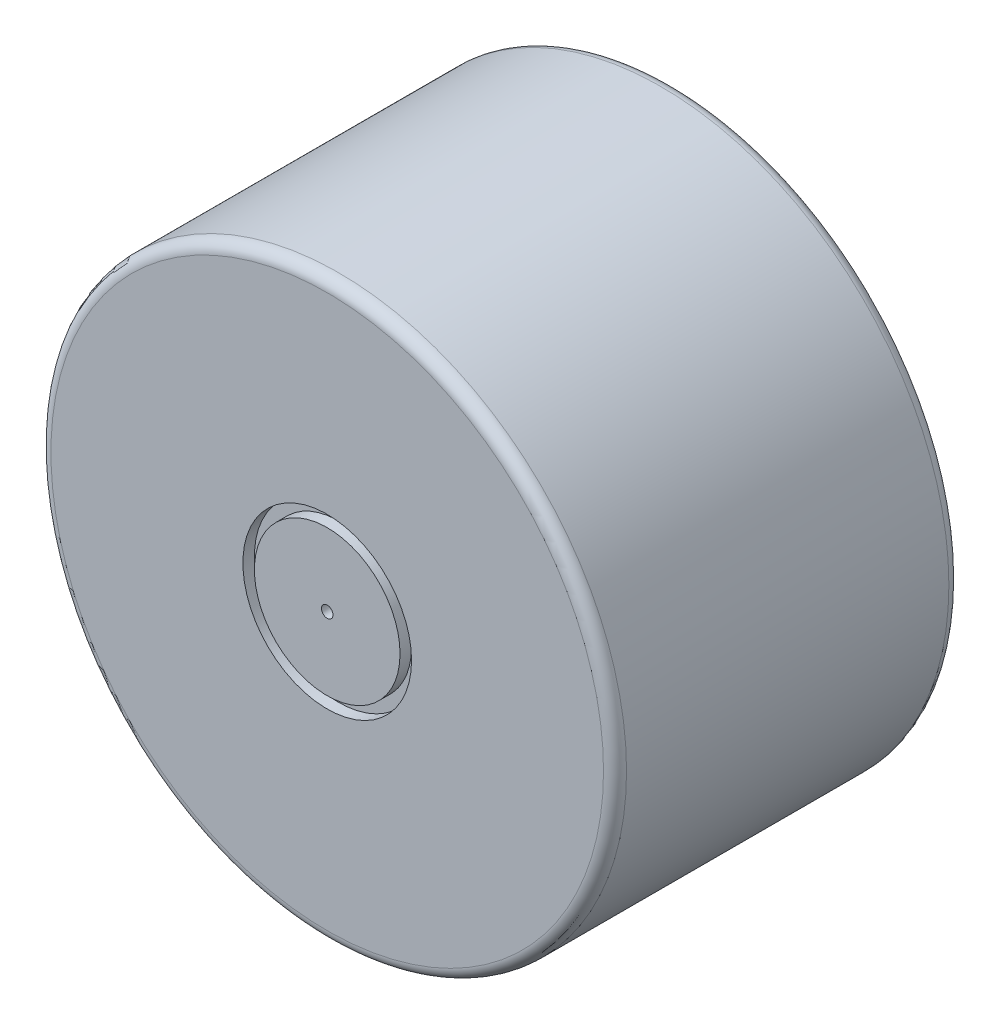
ISO-10303-21;
HEADER;
FILE_DESCRIPTION(('STEP AP214'),'2;1');
FILE_NAME('part.step','',(''),(''),'','','');
FILE_SCHEMA(('AUTOMOTIVE_DESIGN { 1 0 10303 214 1 1 1 1 }'));
ENDSEC;
DATA;
#1=APPLICATION_CONTEXT('core data for automotive mechanical design processes');
#2=APPLICATION_PROTOCOL_DEFINITION('international standard','automotive_design',2000,#1);
#3=PRODUCT_CONTEXT('',#1,'mechanical');
#4=PRODUCT('Part','Part','',(#3));
#5=PRODUCT_RELATED_PRODUCT_CATEGORY('part','',(#4));
#6=PRODUCT_DEFINITION_FORMATION('','',#4);
#7=PRODUCT_DEFINITION_CONTEXT('part definition',#1,'design');
#8=PRODUCT_DEFINITION('design','',#6,#7);
#9=PRODUCT_DEFINITION_SHAPE('','',#8);
#10=(LENGTH_UNIT() NAMED_UNIT(*) SI_UNIT(.MILLI.,.METRE.));
#11=(NAMED_UNIT(*) PLANE_ANGLE_UNIT() SI_UNIT($,.RADIAN.));
#12=(NAMED_UNIT(*) SI_UNIT($,.STERADIAN.) SOLID_ANGLE_UNIT());
#13=UNCERTAINTY_MEASURE_WITH_UNIT(LENGTH_MEASURE(1.E-05),#10,'distance_accuracy_value','');
#14=(GEOMETRIC_REPRESENTATION_CONTEXT(3) GLOBAL_UNCERTAINTY_ASSIGNED_CONTEXT((#13)) GLOBAL_UNIT_ASSIGNED_CONTEXT((#10,
#11,#12)) REPRESENTATION_CONTEXT('',''));
#15=CARTESIAN_POINT('',(0.,0.,0.));
#16=DIRECTION('',(0.,0.,1.));
#17=DIRECTION('',(1.,0.,0.));
#18=AXIS2_PLACEMENT_3D('',#15,#16,#17);
#19=CARTESIAN_POINT('',(0.,0.,100.));
#20=DIRECTION('',(0.,0.,-1.));
#21=DIRECTION('',(-1.,0.,0.));
#22=AXIS2_PLACEMENT_3D('',#19,#20,#21);
#23=CYLINDRICAL_SURFACE('',#22,89.8188429259294);
#24=CARTESIAN_POINT('',(0.,0.,100.));
#25=DIRECTION('',(0.,0.,-1.));
#26=DIRECTION('',(-1.,0.,0.));
#27=AXIS2_PLACEMENT_3D('',#24,#25,#26);
#28=CIRCLE('',#27,89.8188429259294);
#29=CARTESIAN_POINT('',(-89.8188429259294,0.,100.));
#30=VERTEX_POINT('',#29);
#31=EDGE_CURVE('E116',#30,#30,#28,.T.);
#32=ORIENTED_EDGE('',*,*,#31,.T.);
#33=EDGE_LOOP('',(#32));
#34=FACE_BOUND('',#33,.T.);
#35=CARTESIAN_POINT('',(0.,0.,20.));
#36=DIRECTION('',(0.,0.,-1.));
#37=DIRECTION('',(-1.,0.,0.));
#38=AXIS2_PLACEMENT_3D('',#35,#36,#37);
#39=CIRCLE('',#38,89.8188429259294);
#40=CARTESIAN_POINT('',(-89.8188429259294,0.,20.));
#41=VERTEX_POINT('',#40);
#42=EDGE_CURVE('E114',#41,#41,#39,.T.);
#43=ORIENTED_EDGE('',*,*,#42,.F.);
#44=EDGE_LOOP('',(#43));
#45=FACE_BOUND('',#44,.T.);
#46=ADVANCED_FACE('F31',(#34,#45),#23,.T.);
#47=CARTESIAN_POINT('',(0.,0.,300.));
#48=DIRECTION('',(0.,0.,-1.));
#49=DIRECTION('',(-1.,0.,0.));
#50=AXIS2_PLACEMENT_3D('',#47,#48,#49);
#51=CYLINDRICAL_SURFACE('',#50,250.);
#52=CARTESIAN_POINT('',(0.,0.,10.));
#53=DIRECTION('',(0.,0.,1.));
#54=DIRECTION('',(1.,0.,0.));
#55=AXIS2_PLACEMENT_3D('',#52,#53,#54);
#56=CIRCLE('',#55,250.);
#57=CARTESIAN_POINT('',(250.,0.,10.));
#58=VERTEX_POINT('',#57);
#59=EDGE_CURVE('E131',#58,#58,#56,.T.);
#60=ORIENTED_EDGE('',*,*,#59,.T.);
#61=EDGE_LOOP('',(#60));
#62=FACE_BOUND('',#61,.T.);
#63=CARTESIAN_POINT('',(0.,0.,290.));
#64=DIRECTION('',(0.,0.,1.));
#65=DIRECTION('',(1.,0.,0.));
#66=AXIS2_PLACEMENT_3D('',#63,#64,#65);
#67=CIRCLE('',#66,250.);
#68=CARTESIAN_POINT('',(250.,0.,290.));
#69=VERTEX_POINT('',#68);
#70=EDGE_CURVE('E128',#69,#69,#67,.F.);
#71=ORIENTED_EDGE('',*,*,#70,.T.);
#72=EDGE_LOOP('',(#71));
#73=FACE_BOUND('',#72,.T.);
#74=ADVANCED_FACE('F33',(#62,#73),#51,.T.);
#75=CARTESIAN_POINT('',(0.,0.,300.));
#76=DIRECTION('',(0.,0.,1.));
#77=DIRECTION('',(1.,0.,0.));
#78=AXIS2_PLACEMENT_3D('',#75,#76,#77);
#79=PLANE('',#78);
#80=CARTESIAN_POINT('',(0.,0.,300.));
#81=DIRECTION('',(0.,0.,1.));
#82=DIRECTION('',(1.,0.,0.));
#83=AXIS2_PLACEMENT_3D('',#80,#81,#82);
#84=CIRCLE('',#83,73.2583375526463);
#85=CARTESIAN_POINT('',(73.2583375526463,0.,300.));
#86=VERTEX_POINT('',#85);
#87=EDGE_CURVE('E106',#86,#86,#84,.T.);
#88=ORIENTED_EDGE('',*,*,#87,.F.);
#89=EDGE_LOOP('',(#88));
#90=FACE_BOUND('',#89,.T.);
#91=CARTESIAN_POINT('',(0.,0.,300.));
#92=DIRECTION('',(0.,0.,1.));
#93=DIRECTION('',(1.,0.,0.));
#94=AXIS2_PLACEMENT_3D('',#91,#92,#93);
#95=CIRCLE('',#94,240.);
#96=CARTESIAN_POINT('',(240.,0.,300.));
#97=VERTEX_POINT('',#96);
#98=EDGE_CURVE('E11',#97,#97,#95,.T.);
#99=ORIENTED_EDGE('',*,*,#98,.T.);
#100=EDGE_LOOP('',(#99));
#101=FACE_BOUND('',#100,.T.);
#102=ADVANCED_FACE('F64',(#90,#101),#79,.T.);
#103=CARTESIAN_POINT('',(0.,0.,0.));
#104=DIRECTION('',(0.,0.,1.));
#105=DIRECTION('',(1.,0.,0.));
#106=AXIS2_PLACEMENT_3D('',#103,#104,#105);
#107=PLANE('',#106);
#108=CARTESIAN_POINT('',(0.,0.,0.));
#109=DIRECTION('',(0.,0.,1.));
#110=DIRECTION('',(1.,0.,0.));
#111=AXIS2_PLACEMENT_3D('',#108,#109,#110);
#112=CIRCLE('',#111,240.);
#113=CARTESIAN_POINT('',(240.,0.,0.));
#114=VERTEX_POINT('',#113);
#115=EDGE_CURVE('E38',#114,#114,#112,.F.);
#116=ORIENTED_EDGE('',*,*,#115,.T.);
#117=EDGE_LOOP('',(#116));
#118=FACE_BOUND('',#117,.T.);
#119=CARTESIAN_POINT('',(0.,0.,0.));
#120=DIRECTION('',(0.,0.,-1.));
#121=DIRECTION('',(-1.,0.,0.));
#122=AXIS2_PLACEMENT_3D('',#119,#120,#121);
#123=CIRCLE('',#122,200.);
#124=CARTESIAN_POINT('',(-200.,0.,0.));
#125=VERTEX_POINT('',#124);
#126=EDGE_CURVE('E118',#125,#125,#123,.T.);
#127=ORIENTED_EDGE('',*,*,#126,.F.);
#128=EDGE_LOOP('',(#127));
#129=FACE_BOUND('',#128,.T.);
#130=ADVANCED_FACE('F71',(#118,#129),#107,.F.);
#131=CARTESIAN_POINT('',(0.,0.,100.));
#132=DIRECTION('',(0.,0.,-1.));
#133=DIRECTION('',(-1.,0.,0.));
#134=AXIS2_PLACEMENT_3D('',#131,#132,#133);
#135=CYLINDRICAL_SURFACE('',#134,200.);
#136=CARTESIAN_POINT('',(0.,0.,100.));
#137=DIRECTION('',(0.,0.,-1.));
#138=DIRECTION('',(-1.,0.,0.));
#139=AXIS2_PLACEMENT_3D('',#136,#137,#138);
#140=CIRCLE('',#139,200.);
#141=CARTESIAN_POINT('',(-200.,0.,100.));
#142=VERTEX_POINT('',#141);
#143=EDGE_CURVE('E121',#142,#142,#140,.T.);
#144=ORIENTED_EDGE('',*,*,#143,.F.);
#145=EDGE_LOOP('',(#144));
#146=FACE_BOUND('',#145,.T.);
#147=ORIENTED_EDGE('',*,*,#126,.T.);
#148=EDGE_LOOP('',(#147));
#149=FACE_BOUND('',#148,.T.);
#150=ADVANCED_FACE('F54',(#146,#149),#135,.F.);
#151=CARTESIAN_POINT('',(0.,0.,100.));
#152=DIRECTION('',(0.,0.,-1.));
#153=DIRECTION('',(-1.,0.,0.));
#154=AXIS2_PLACEMENT_3D('',#151,#152,#153);
#155=PLANE('',#154);
#156=ORIENTED_EDGE('',*,*,#31,.F.);
#157=EDGE_LOOP('',(#156));
#158=FACE_BOUND('',#157,.T.);
#159=ORIENTED_EDGE('',*,*,#143,.T.);
#160=EDGE_LOOP('',(#159));
#161=FACE_BOUND('',#160,.T.);
#162=ADVANCED_FACE('F44',(#158,#161),#155,.T.);
#163=CARTESIAN_POINT('',(11.1701073190481,0.,161.521307876054));
#164=DIRECTION('',(0.,-1.,0.));
#165=DIRECTION('',(1.,0.,0.));
#166=AXIS2_PLACEMENT_3D('',#163,#164,#165);
#167=CIRCLE('',#166,161.907085068906);
#168=TRIMMED_CURVE('',#167,(PARAMETER_VALUE(-1.63984202344945)),
(PARAMETER_VALUE(1.63984202344945)),.T.,.PARAMETER.);
#169=CARTESIAN_POINT('',(2.23779328401008E-13,0.,161.521307876054));
#170=DIRECTION('',(0.,0.,1.));
#171=AXIS1_PLACEMENT('',#169,#170);
#172=SURFACE_OF_REVOLUTION('',#168,#171);
#173=ORIENTED_EDGE('',*,*,#42,.T.);
#174=EDGE_LOOP('',(#173));
#175=FACE_BOUND('',#174,.T.);
#176=CARTESIAN_POINT('',(0.,0.,0.));
#177=VERTEX_POINT('',#176);
#178=VERTEX_LOOP('',#177);
#179=FACE_BOUND('',#178,.T.);
#180=ADVANCED_FACE('F41',(#175,#179),#172,.T.);
#181=CARTESIAN_POINT('',(0.,0.,10.));
#182=DIRECTION('',(0.,0.,1.));
#183=DIRECTION('',(1.,0.,0.));
#184=AXIS2_PLACEMENT_3D('',#181,#182,#183);
#185=TOROIDAL_SURFACE('',#184,240.,10.);
#186=ORIENTED_EDGE('',*,*,#115,.F.);
#187=EDGE_LOOP('',(#186));
#188=FACE_BOUND('',#187,.T.);
#189=ORIENTED_EDGE('',*,*,#59,.F.);
#190=EDGE_LOOP('',(#189));
#191=FACE_BOUND('',#190,.T.);
#192=ADVANCED_FACE('F43',(#188,#191),#185,.T.);
#193=CARTESIAN_POINT('',(0.,0.,290.));
#194=DIRECTION('',(0.,0.,1.));
#195=DIRECTION('',(1.,0.,0.));
#196=AXIS2_PLACEMENT_3D('',#193,#194,#195);
#197=TOROIDAL_SURFACE('',#196,240.,10.);
#198=ORIENTED_EDGE('',*,*,#70,.F.);
#199=EDGE_LOOP('',(#198));
#200=FACE_BOUND('',#199,.T.);
#201=ORIENTED_EDGE('',*,*,#98,.F.);
#202=EDGE_LOOP('',(#201));
#203=FACE_BOUND('',#202,.T.);
#204=ADVANCED_FACE('F51',(#200,#203),#197,.T.);
#205=CARTESIAN_POINT('',(0.,0.,290.));
#206=DIRECTION('',(0.,0.,1.));
#207=DIRECTION('',(1.,0.,0.));
#208=AXIS2_PLACEMENT_3D('',#205,#206,#207);
#209=CYLINDRICAL_SURFACE('',#208,73.2583375526463);
#210=CARTESIAN_POINT('',(0.,0.,290.));
#211=DIRECTION('',(0.,0.,1.));
#212=DIRECTION('',(1.,0.,0.));
#213=AXIS2_PLACEMENT_3D('',#210,#211,#212);
#214=CIRCLE('',#213,73.2583375526463);
#215=CARTESIAN_POINT('',(73.2583375526463,0.,290.));
#216=VERTEX_POINT('',#215);
#217=EDGE_CURVE('E111',#216,#216,#214,.T.);
#218=ORIENTED_EDGE('',*,*,#217,.F.);
#219=EDGE_LOOP('',(#218));
#220=FACE_BOUND('',#219,.T.);
#221=ORIENTED_EDGE('',*,*,#87,.T.);
#222=EDGE_LOOP('',(#221));
#223=FACE_BOUND('',#222,.T.);
#224=ADVANCED_FACE('F143',(#220,#223),#209,.F.);
#225=CARTESIAN_POINT('',(0.,0.,290.));
#226=DIRECTION('',(0.,0.,1.));
#227=DIRECTION('',(1.,0.,0.));
#228=AXIS2_PLACEMENT_3D('',#225,#226,#227);
#229=PLANE('',#228);
#230=CARTESIAN_POINT('',(0.,0.,290.));
#231=DIRECTION('',(0.,0.,1.));
#232=DIRECTION('',(1.,0.,0.));
#233=AXIS2_PLACEMENT_3D('',#230,#231,#232);
#234=CIRCLE('',#233,63.2583375526463);
#235=CARTESIAN_POINT('',(63.2583375526463,0.,290.));
#236=VERTEX_POINT('',#235);
#237=EDGE_CURVE('E103',#236,#236,#234,.T.);
#238=ORIENTED_EDGE('',*,*,#237,.F.);
#239=EDGE_LOOP('',(#238));
#240=FACE_BOUND('',#239,.T.);
#241=ORIENTED_EDGE('',*,*,#217,.T.);
#242=EDGE_LOOP('',(#241));
#243=FACE_BOUND('',#242,.T.);
#244=ADVANCED_FACE('F149',(#240,#243),#229,.T.);
#245=CARTESIAN_POINT('',(0.,0.,290.));
#246=DIRECTION('',(0.,0.,1.));
#247=DIRECTION('',(1.,0.,0.));
#248=AXIS2_PLACEMENT_3D('',#245,#246,#247);
#249=CYLINDRICAL_SURFACE('',#248,63.2583375526463);
#250=ORIENTED_EDGE('',*,*,#237,.T.);
#251=EDGE_LOOP('',(#250));
#252=FACE_BOUND('',#251,.T.);
#253=CARTESIAN_POINT('',(0.,0.,300.));
#254=DIRECTION('',(0.,0.,1.));
#255=DIRECTION('',(1.,0.,0.));
#256=AXIS2_PLACEMENT_3D('',#253,#254,#255);
#257=CIRCLE('',#256,63.2583375526463);
#258=CARTESIAN_POINT('',(63.2583375526463,0.,300.));
#259=VERTEX_POINT('',#258);
#260=EDGE_CURVE('E101',#259,#259,#257,.T.);
#261=ORIENTED_EDGE('',*,*,#260,.F.);
#262=EDGE_LOOP('',(#261));
#263=FACE_BOUND('',#262,.T.);
#264=ADVANCED_FACE('F77',(#252,#263),#249,.T.);
#265=CARTESIAN_POINT('',(0.,0.,280.));
#266=DIRECTION('',(0.,0.,1.));
#267=DIRECTION('',(1.,0.,0.));
#268=AXIS2_PLACEMENT_3D('',#265,#266,#267);
#269=PLANE('',#268);
#270=CARTESIAN_POINT('',(0.,0.,280.));
#271=DIRECTION('',(0.,0.,1.));
#272=DIRECTION('',(1.,0.,0.));
#273=AXIS2_PLACEMENT_3D('',#270,#271,#272);
#274=CIRCLE('',#273,5.);
#275=CARTESIAN_POINT('',(5.,0.,280.));
#276=VERTEX_POINT('',#275);
#277=EDGE_CURVE('E125',#276,#276,#274,.T.);
#278=ORIENTED_EDGE('',*,*,#277,.T.);
#279=EDGE_LOOP('',(#278));
#280=FACE_BOUND('',#279,.T.);
#281=ADVANCED_FACE('F73',(#280),#269,.T.);
#282=CARTESIAN_POINT('',(0.,0.,280.));
#283=DIRECTION('',(0.,0.,1.));
#284=DIRECTION('',(1.,0.,0.));
#285=AXIS2_PLACEMENT_3D('',#282,#283,#284);
#286=CYLINDRICAL_SURFACE('',#285,5.);
#287=ORIENTED_EDGE('',*,*,#277,.F.);
#288=EDGE_LOOP('',(#287));
#289=FACE_BOUND('',#288,.T.);
#290=CARTESIAN_POINT('',(0.,0.,300.));
#291=DIRECTION('',(0.,0.,1.));
#292=DIRECTION('',(1.,0.,0.));
#293=AXIS2_PLACEMENT_3D('',#290,#291,#292);
#294=CIRCLE('',#293,5.);
#295=CARTESIAN_POINT('',(5.,0.,300.));
#296=VERTEX_POINT('',#295);
#297=EDGE_CURVE('E98',#296,#296,#294,.T.);
#298=ORIENTED_EDGE('',*,*,#297,.T.);
#299=EDGE_LOOP('',(#298));
#300=FACE_BOUND('',#299,.T.);
#301=ADVANCED_FACE('F76',(#289,#300),#286,.F.);
#302=ORIENTED_EDGE('',*,*,#297,.F.);
#303=EDGE_LOOP('',(#302));
#304=FACE_BOUND('',#303,.T.);
#305=ORIENTED_EDGE('',*,*,#260,.T.);
#306=EDGE_LOOP('',(#305));
#307=FACE_BOUND('',#306,.T.);
#308=ADVANCED_FACE('F81',(#304,#307),#79,.T.);
#309=CLOSED_SHELL('',(#46,#74,#102,#130,#150,#162,#180,#192,#204,#224,#244,#264,#281,#301,#308));
#310=MANIFOLD_SOLID_BREP('B2',#309);
#311=ADVANCED_BREP_SHAPE_REPRESENTATION('',(#18,#310),#14);
#312=SHAPE_DEFINITION_REPRESENTATION(#9,#311);
ENDSEC;
END-ISO-10303-21;
